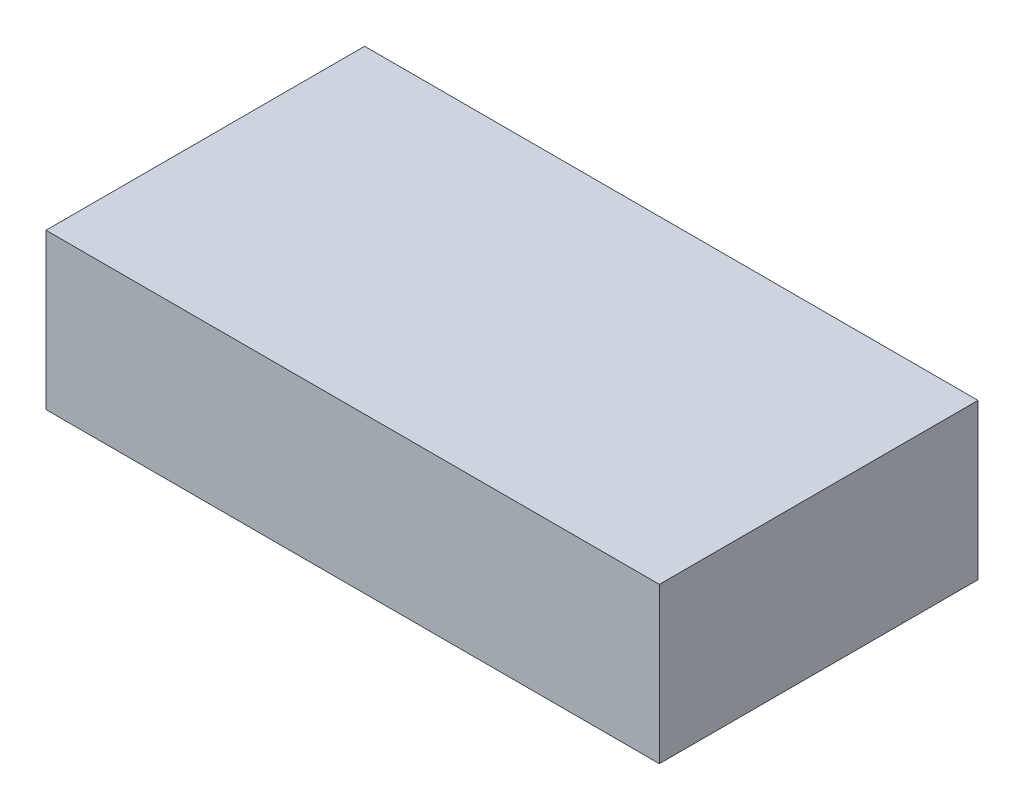
ISO-10303-21;
HEADER;
FILE_DESCRIPTION(('STEP AP214'),'2;1');
FILE_NAME('part.step','',(''),(''),'','','');
FILE_SCHEMA(('AUTOMOTIVE_DESIGN { 1 0 10303 214 1 1 1 1 }'));
ENDSEC;
DATA;
#1=APPLICATION_CONTEXT('core data for automotive mechanical design processes');
#2=APPLICATION_PROTOCOL_DEFINITION('international standard','automotive_design',2000,#1);
#3=PRODUCT_CONTEXT('',#1,'mechanical');
#4=PRODUCT('Part','Part','',(#3));
#5=PRODUCT_RELATED_PRODUCT_CATEGORY('part','',(#4));
#6=PRODUCT_DEFINITION_FORMATION('','',#4);
#7=PRODUCT_DEFINITION_CONTEXT('part definition',#1,'design');
#8=PRODUCT_DEFINITION('design','',#6,#7);
#9=PRODUCT_DEFINITION_SHAPE('','',#8);
#10=(LENGTH_UNIT() NAMED_UNIT(*) SI_UNIT(.MILLI.,.METRE.));
#11=(NAMED_UNIT(*) PLANE_ANGLE_UNIT() SI_UNIT($,.RADIAN.));
#12=(NAMED_UNIT(*) SI_UNIT($,.STERADIAN.) SOLID_ANGLE_UNIT());
#13=UNCERTAINTY_MEASURE_WITH_UNIT(LENGTH_MEASURE(1.E-05),#10,'distance_accuracy_value','');
#14=(GEOMETRIC_REPRESENTATION_CONTEXT(3) GLOBAL_UNCERTAINTY_ASSIGNED_CONTEXT((#13)) GLOBAL_UNIT_ASSIGNED_CONTEXT((#10,
#11,#12)) REPRESENTATION_CONTEXT('',''));
#15=CARTESIAN_POINT('',(0.,0.,0.));
#16=DIRECTION('',(0.,0.,1.));
#17=DIRECTION('',(1.,0.,0.));
#18=AXIS2_PLACEMENT_3D('',#15,#16,#17);
#19=CARTESIAN_POINT('',(0.77,0.03,0.8));
#20=DIRECTION('',(-1.,0.,0.));
#21=DIRECTION('',(0.,0.707106781186548,0.707106781186548));
#22=AXIS2_PLACEMENT_3D('',#19,#20,#21);
#23=PLANE('',#22);
#24=DIRECTION('',(0.,1.,0.));
#25=VECTOR('',#24,1.);
#26=CARTESIAN_POINT('',(0.77,0.03,0.));
#27=LINE('',#26,#25);
#28=CARTESIAN_POINT('',(0.77,0.03,0.));
#29=VERTEX_POINT('',#28);
#30=CARTESIAN_POINT('',(0.77,0.42,0.));
#31=VERTEX_POINT('',#30);
#32=EDGE_CURVE('E11',#29,#31,#27,.T.);
#33=ORIENTED_EDGE('',*,*,#32,.T.);
#34=DIRECTION('',(0.,0.,-1.));
#35=VECTOR('',#34,1.);
#36=CARTESIAN_POINT('',(0.77,0.42,0.8));
#37=LINE('',#36,#35);
#38=CARTESIAN_POINT('',(0.77,0.42,0.8));
#39=VERTEX_POINT('',#38);
#40=EDGE_CURVE('E35',#39,#31,#37,.T.);
#41=ORIENTED_EDGE('',*,*,#40,.F.);
#42=DIRECTION('',(0.,1.,0.));
#43=VECTOR('',#42,1.);
#44=CARTESIAN_POINT('',(0.77,0.03,0.8));
#45=LINE('',#44,#43);
#46=CARTESIAN_POINT('',(0.77,0.03,0.8));
#47=VERTEX_POINT('',#46);
#48=EDGE_CURVE('E72',#47,#39,#45,.T.);
#49=ORIENTED_EDGE('',*,*,#48,.F.);
#50=DIRECTION('',(0.,0.,-1.));
#51=VECTOR('',#50,1.);
#52=CARTESIAN_POINT('',(0.77,0.03,0.8));
#53=LINE('',#52,#51);
#54=EDGE_CURVE('E26',#47,#29,#53,.T.);
#55=ORIENTED_EDGE('',*,*,#54,.T.);
#56=EDGE_LOOP('',(#33,#41,#49,#55));
#57=FACE_BOUND('',#56,.T.);
#58=ADVANCED_FACE('F16',(#57),#23,.F.);
#59=CARTESIAN_POINT('',(0.77,0.42,0.8));
#60=DIRECTION('',(0.,-1.,0.));
#61=DIRECTION('',(0.707106781186548,0.,0.707106781186548));
#62=AXIS2_PLACEMENT_3D('',#59,#60,#61);
#63=PLANE('',#62);
#64=DIRECTION('',(-1.,0.,0.));
#65=VECTOR('',#64,1.);
#66=CARTESIAN_POINT('',(0.77,0.42,0.));
#67=LINE('',#66,#65);
#68=CARTESIAN_POINT('',(-0.77,0.42,0.));
#69=VERTEX_POINT('',#68);
#70=EDGE_CURVE('E79',#31,#69,#67,.T.);
#71=ORIENTED_EDGE('',*,*,#70,.T.);
#72=DIRECTION('',(0.,0.,-1.));
#73=VECTOR('',#72,1.);
#74=CARTESIAN_POINT('',(-0.77,0.42,0.8));
#75=LINE('',#74,#73);
#76=CARTESIAN_POINT('',(-0.77,0.42,0.8));
#77=VERTEX_POINT('',#76);
#78=EDGE_CURVE('E85',#77,#69,#75,.T.);
#79=ORIENTED_EDGE('',*,*,#78,.F.);
#80=DIRECTION('',(-1.,0.,0.));
#81=VECTOR('',#80,1.);
#82=CARTESIAN_POINT('',(0.77,0.42,0.8));
#83=LINE('',#82,#81);
#84=EDGE_CURVE('E63',#39,#77,#83,.T.);
#85=ORIENTED_EDGE('',*,*,#84,.F.);
#86=ORIENTED_EDGE('',*,*,#40,.T.);
#87=EDGE_LOOP('',(#71,#79,#85,#86));
#88=FACE_BOUND('',#87,.T.);
#89=ADVANCED_FACE('F89',(#88),#63,.F.);
#90=CARTESIAN_POINT('',(-0.77,0.03,0.8));
#91=DIRECTION('',(1.,0.,0.));
#92=DIRECTION('',(0.,0.707106781186548,0.707106781186548));
#93=AXIS2_PLACEMENT_3D('',#90,#91,#92);
#94=PLANE('',#93);
#95=DIRECTION('',(0.,-1.,0.));
#96=VECTOR('',#95,1.);
#97=CARTESIAN_POINT('',(-0.77,0.03,0.));
#98=LINE('',#97,#96);
#99=CARTESIAN_POINT('',(-0.77,0.03,0.));
#100=VERTEX_POINT('',#99);
#101=EDGE_CURVE('E69',#69,#100,#98,.T.);
#102=ORIENTED_EDGE('',*,*,#101,.T.);
#103=DIRECTION('',(0.,0.,-1.));
#104=VECTOR('',#103,1.);
#105=CARTESIAN_POINT('',(-0.77,0.03,0.8));
#106=LINE('',#105,#104);
#107=CARTESIAN_POINT('',(-0.77,0.03,0.8));
#108=VERTEX_POINT('',#107);
#109=EDGE_CURVE('E55',#108,#100,#106,.T.);
#110=ORIENTED_EDGE('',*,*,#109,.F.);
#111=DIRECTION('',(0.,-1.,0.));
#112=VECTOR('',#111,1.);
#113=CARTESIAN_POINT('',(-0.77,0.03,0.8));
#114=LINE('',#113,#112);
#115=EDGE_CURVE('E61',#77,#108,#114,.T.);
#116=ORIENTED_EDGE('',*,*,#115,.F.);
#117=ORIENTED_EDGE('',*,*,#78,.T.);
#118=EDGE_LOOP('',(#102,#110,#116,#117));
#119=FACE_BOUND('',#118,.T.);
#120=ADVANCED_FACE('F67',(#119),#94,.F.);
#121=CARTESIAN_POINT('',(0.77,0.03,0.8));
#122=DIRECTION('',(0.,1.,0.));
#123=DIRECTION('',(0.707106781186548,0.,0.707106781186548));
#124=AXIS2_PLACEMENT_3D('',#121,#122,#123);
#125=PLANE('',#124);
#126=DIRECTION('',(1.,0.,0.));
#127=VECTOR('',#126,1.);
#128=CARTESIAN_POINT('',(0.77,0.03,0.));
#129=LINE('',#128,#127);
#130=EDGE_CURVE('E71',#100,#29,#129,.T.);
#131=ORIENTED_EDGE('',*,*,#130,.T.);
#132=ORIENTED_EDGE('',*,*,#54,.F.);
#133=DIRECTION('',(1.,0.,0.));
#134=VECTOR('',#133,1.);
#135=CARTESIAN_POINT('',(0.77,0.03,0.8));
#136=LINE('',#135,#134);
#137=EDGE_CURVE('E20',#108,#47,#136,.T.);
#138=ORIENTED_EDGE('',*,*,#137,.F.);
#139=ORIENTED_EDGE('',*,*,#109,.T.);
#140=EDGE_LOOP('',(#131,#132,#138,#139));
#141=FACE_BOUND('',#140,.T.);
#142=ADVANCED_FACE('F75',(#141),#125,.F.);
#143=CARTESIAN_POINT('',(0.77,0.42,0.8));
#144=DIRECTION('',(0.,0.,1.));
#145=DIRECTION('',(0.707106781186548,0.707106781186548,0.));
#146=AXIS2_PLACEMENT_3D('',#143,#144,#145);
#147=PLANE('',#146);
#148=ORIENTED_EDGE('',*,*,#48,.T.);
#149=ORIENTED_EDGE('',*,*,#84,.T.);
#150=ORIENTED_EDGE('',*,*,#115,.T.);
#151=ORIENTED_EDGE('',*,*,#137,.T.);
#152=EDGE_LOOP('',(#148,#149,#150,#151));
#153=FACE_BOUND('',#152,.T.);
#154=ADVANCED_FACE('F62',(#153),#147,.T.);
#155=CARTESIAN_POINT('',(0.77,0.42,0.));
#156=DIRECTION('',(0.,0.,1.));
#157=DIRECTION('',(0.707106781186548,0.707106781186548,0.));
#158=AXIS2_PLACEMENT_3D('',#155,#156,#157);
#159=PLANE('',#158);
#160=ORIENTED_EDGE('',*,*,#32,.F.);
#161=ORIENTED_EDGE('',*,*,#130,.F.);
#162=ORIENTED_EDGE('',*,*,#101,.F.);
#163=ORIENTED_EDGE('',*,*,#70,.F.);
#164=EDGE_LOOP('',(#160,#161,#162,#163));
#165=FACE_BOUND('',#164,.T.);
#166=ADVANCED_FACE('F18',(#165),#159,.F.);
#167=CLOSED_SHELL('',(#58,#89,#120,#142,#154,#166));
#168=MANIFOLD_SOLID_BREP('B1',#167);
#169=ADVANCED_BREP_SHAPE_REPRESENTATION('',(#18,#168),#14);
#170=SHAPE_DEFINITION_REPRESENTATION(#9,#169);
ENDSEC;
END-ISO-10303-21;
